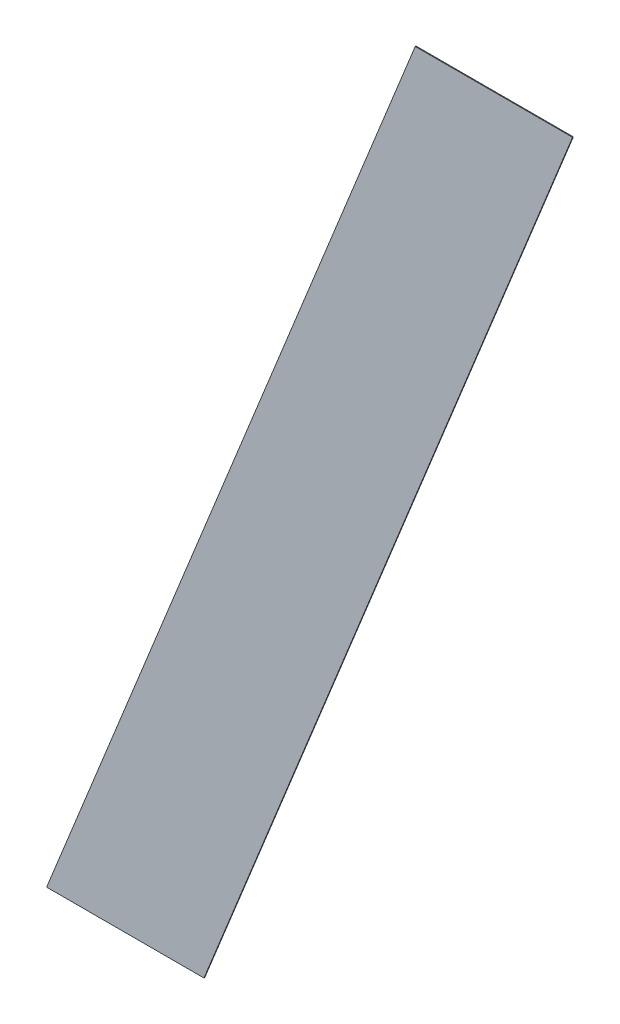
ISO-10303-21;
HEADER;
FILE_DESCRIPTION(('STEP AP214'),'2;1');
FILE_NAME('part.step','',(''),(''),'','','');
FILE_SCHEMA(('AUTOMOTIVE_DESIGN { 1 0 10303 214 1 1 1 1 }'));
ENDSEC;
DATA;
#1=APPLICATION_CONTEXT('core data for automotive mechanical design processes');
#2=APPLICATION_PROTOCOL_DEFINITION('international standard','automotive_design',2000,#1);
#3=PRODUCT_CONTEXT('',#1,'mechanical');
#4=PRODUCT('Part','Part','',(#3));
#5=PRODUCT_RELATED_PRODUCT_CATEGORY('part','',(#4));
#6=PRODUCT_DEFINITION_FORMATION('','',#4);
#7=PRODUCT_DEFINITION_CONTEXT('part definition',#1,'design');
#8=PRODUCT_DEFINITION('design','',#6,#7);
#9=PRODUCT_DEFINITION_SHAPE('','',#8);
#10=(LENGTH_UNIT() NAMED_UNIT(*) SI_UNIT(.MILLI.,.METRE.));
#11=(NAMED_UNIT(*) PLANE_ANGLE_UNIT() SI_UNIT($,.RADIAN.));
#12=(NAMED_UNIT(*) SI_UNIT($,.STERADIAN.) SOLID_ANGLE_UNIT());
#13=UNCERTAINTY_MEASURE_WITH_UNIT(LENGTH_MEASURE(1.E-05),#10,'distance_accuracy_value','');
#14=(GEOMETRIC_REPRESENTATION_CONTEXT(3) GLOBAL_UNCERTAINTY_ASSIGNED_CONTEXT((#13)) GLOBAL_UNIT_ASSIGNED_CONTEXT((#10,
#11,#12)) REPRESENTATION_CONTEXT('',''));
#15=CARTESIAN_POINT('',(0.,0.,0.));
#16=DIRECTION('',(0.,0.,1.));
#17=DIRECTION('',(1.,0.,0.));
#18=AXIS2_PLACEMENT_3D('',#15,#16,#17);
#19=CARTESIAN_POINT('',(0.3590009185743,-0.192580169588,0.0009));
#20=DIRECTION('',(0.,0.,-1.));
#21=DIRECTION('',(-1.,0.,0.));
#22=AXIS2_PLACEMENT_3D('',#19,#20,#21);
#23=PLANE('',#22);
#24=DIRECTION('',(-1.,0.,0.));
#25=VECTOR('',#24,1.);
#26=CARTESIAN_POINT('',(0.3458299068488,-0.192580169588,0.0009));
#27=LINE('',#26,#25);
#28=CARTESIAN_POINT('',(0.3458299068488,-0.192580169588,0.0009));
#29=VERTEX_POINT('',#28);
#30=CARTESIAN_POINT('',(0.3262099068488,-0.192580169588,0.0009));
#31=VERTEX_POINT('',#30);
#32=EDGE_CURVE('E11',#29,#31,#27,.T.);
#33=ORIENTED_EDGE('',*,*,#32,.T.);
#34=DIRECTION('',(0.37460659341586,0.927183854566808,0.));
#35=VECTOR('',#34,1.);
#36=CARTESIAN_POINT('',(0.3262099068488,-0.192580169588,0.0009));
#37=LINE('',#36,#35);
#38=CARTESIAN_POINT('',(0.3721719302998,-0.078820169588,0.0009));
#39=VERTEX_POINT('',#38);
#40=EDGE_CURVE('E24',#31,#39,#37,.T.);
#41=ORIENTED_EDGE('',*,*,#40,.T.);
#42=DIRECTION('',(1.,0.,0.));
#43=VECTOR('',#42,1.);
#44=CARTESIAN_POINT('',(0.3721719302998,-0.078820169588,0.0009));
#45=LINE('',#44,#43);
#46=CARTESIAN_POINT('',(0.3917919302998,-0.078820169588,0.0009));
#47=VERTEX_POINT('',#46);
#48=EDGE_CURVE('E70',#39,#47,#45,.T.);
#49=ORIENTED_EDGE('',*,*,#48,.T.);
#50=DIRECTION('',(-0.374606593415159,-0.927183854567092,0.));
#51=VECTOR('',#50,1.);
#52=CARTESIAN_POINT('',(0.3917919302998,-0.078820169588,0.0009));
#53=LINE('',#52,#51);
#54=EDGE_CURVE('E86',#47,#29,#53,.T.);
#55=ORIENTED_EDGE('',*,*,#54,.T.);
#56=EDGE_LOOP('',(#33,#41,#49,#55));
#57=FACE_BOUND('',#56,.T.);
#58=ADVANCED_FACE('F17',(#57),#23,.T.);
#59=CARTESIAN_POINT('',(0.3360199068488,-0.192580169588,0.0009));
#60=DIRECTION('',(0.,-1.,0.));
#61=DIRECTION('',(0.,0.,-1.));
#62=AXIS2_PLACEMENT_3D('',#59,#60,#61);
#63=PLANE('',#62);
#64=DIRECTION('',(1.,0.,0.));
#65=VECTOR('',#64,1.);
#66=CARTESIAN_POINT('',(0.3262099068488,-0.192580169588,0.001));
#67=LINE('',#66,#65);
#68=CARTESIAN_POINT('',(0.3262099068488,-0.192580169588,0.001));
#69=VERTEX_POINT('',#68);
#70=CARTESIAN_POINT('',(0.3458299068488,-0.192580169588,0.001));
#71=VERTEX_POINT('',#70);
#72=EDGE_CURVE('E84',#69,#71,#67,.T.);
#73=ORIENTED_EDGE('',*,*,#72,.F.);
#74=DIRECTION('',(0.,0.,-1.));
#75=VECTOR('',#74,1.);
#76=CARTESIAN_POINT('',(0.3262099068488,-0.192580169588,0.001));
#77=LINE('',#76,#75);
#78=EDGE_CURVE('E75',#69,#31,#77,.T.);
#79=ORIENTED_EDGE('',*,*,#78,.T.);
#80=ORIENTED_EDGE('',*,*,#32,.F.);
#81=DIRECTION('',(0.,0.,-1.));
#82=VECTOR('',#81,1.);
#83=CARTESIAN_POINT('',(0.3458299068488,-0.192580169588,0.001));
#84=LINE('',#83,#82);
#85=EDGE_CURVE('E80',#71,#29,#84,.T.);
#86=ORIENTED_EDGE('',*,*,#85,.F.);
#87=EDGE_LOOP('',(#73,#79,#80,#86));
#88=FACE_BOUND('',#87,.T.);
#89=ADVANCED_FACE('F89',(#88),#63,.T.);
#90=CARTESIAN_POINT('',(0.3688109185743,-0.135700169588,0.0009));
#91=DIRECTION('',(0.927183854566809,-0.37460659341586,0.));
#92=DIRECTION('',(0.,0.,-1.));
#93=AXIS2_PLACEMENT_3D('',#90,#91,#92);
#94=PLANE('',#93);
#95=DIRECTION('',(0.37460659341586,0.927183854566809,0.));
#96=VECTOR('',#95,1.);
#97=CARTESIAN_POINT('',(0.3458299068488,-0.192580169588,0.001));
#98=LINE('',#97,#96);
#99=CARTESIAN_POINT('',(0.3917919302998,-0.078820169588,0.001));
#100=VERTEX_POINT('',#99);
#101=EDGE_CURVE('E60',#71,#100,#98,.T.);
#102=ORIENTED_EDGE('',*,*,#101,.F.);
#103=ORIENTED_EDGE('',*,*,#85,.T.);
#104=ORIENTED_EDGE('',*,*,#54,.F.);
#105=DIRECTION('',(0.,0.,-1.));
#106=VECTOR('',#105,1.);
#107=CARTESIAN_POINT('',(0.3917919302998,-0.078820169588,0.001));
#108=LINE('',#107,#106);
#109=EDGE_CURVE('E64',#100,#47,#108,.T.);
#110=ORIENTED_EDGE('',*,*,#109,.F.);
#111=EDGE_LOOP('',(#102,#103,#104,#110));
#112=FACE_BOUND('',#111,.T.);
#113=ADVANCED_FACE('F91',(#112),#94,.T.);
#114=CARTESIAN_POINT('',(0.3819819302998,-0.078820169588,0.0009));
#115=DIRECTION('',(0.,1.,0.));
#116=DIRECTION('',(0.,0.,1.));
#117=AXIS2_PLACEMENT_3D('',#114,#115,#116);
#118=PLANE('',#117);
#119=DIRECTION('',(-1.,0.,0.));
#120=VECTOR('',#119,1.);
#121=CARTESIAN_POINT('',(0.3917919302998,-0.078820169588,0.001));
#122=LINE('',#121,#120);
#123=CARTESIAN_POINT('',(0.3721719302998,-0.078820169588,0.001));
#124=VERTEX_POINT('',#123);
#125=EDGE_CURVE('E54',#100,#124,#122,.T.);
#126=ORIENTED_EDGE('',*,*,#125,.F.);
#127=ORIENTED_EDGE('',*,*,#109,.T.);
#128=ORIENTED_EDGE('',*,*,#48,.F.);
#129=DIRECTION('',(0.,0.,-1.));
#130=VECTOR('',#129,1.);
#131=CARTESIAN_POINT('',(0.3721719302998,-0.078820169588,0.001));
#132=LINE('',#131,#130);
#133=EDGE_CURVE('E65',#124,#39,#132,.T.);
#134=ORIENTED_EDGE('',*,*,#133,.F.);
#135=EDGE_LOOP('',(#126,#127,#128,#134));
#136=FACE_BOUND('',#135,.T.);
#137=ADVANCED_FACE('F69',(#136),#118,.T.);
#138=CARTESIAN_POINT('',(0.3491909185743,-0.135700169588,0.0009));
#139=DIRECTION('',(-0.927183854566808,0.37460659341586,0.));
#140=DIRECTION('',(0.,0.,1.));
#141=AXIS2_PLACEMENT_3D('',#138,#139,#140);
#142=PLANE('',#141);
#143=DIRECTION('',(-0.37460659341586,-0.927183854566808,0.));
#144=VECTOR('',#143,1.);
#145=CARTESIAN_POINT('',(0.3721719302998,-0.078820169588,0.001));
#146=LINE('',#145,#144);
#147=EDGE_CURVE('E58',#124,#69,#146,.T.);
#148=ORIENTED_EDGE('',*,*,#147,.F.);
#149=ORIENTED_EDGE('',*,*,#133,.T.);
#150=ORIENTED_EDGE('',*,*,#40,.F.);
#151=ORIENTED_EDGE('',*,*,#78,.F.);
#152=EDGE_LOOP('',(#148,#149,#150,#151));
#153=FACE_BOUND('',#152,.T.);
#154=ADVANCED_FACE('F74',(#153),#142,.T.);
#155=CARTESIAN_POINT('',(0.3590009185743,-0.192580169588,0.001));
#156=DIRECTION('',(0.,0.,-1.));
#157=DIRECTION('',(-1.,0.,0.));
#158=AXIS2_PLACEMENT_3D('',#155,#156,#157);
#159=PLANE('',#158);
#160=ORIENTED_EDGE('',*,*,#125,.T.);
#161=ORIENTED_EDGE('',*,*,#147,.T.);
#162=ORIENTED_EDGE('',*,*,#72,.T.);
#163=ORIENTED_EDGE('',*,*,#101,.T.);
#164=EDGE_LOOP('',(#160,#161,#162,#163));
#165=FACE_BOUND('',#164,.T.);
#166=ADVANCED_FACE('F56',(#165),#159,.F.);
#167=CLOSED_SHELL('',(#58,#89,#113,#137,#154,#166));
#168=MANIFOLD_SOLID_BREP('B1',#167);
#169=ADVANCED_BREP_SHAPE_REPRESENTATION('',(#18,#168),#14);
#170=SHAPE_DEFINITION_REPRESENTATION(#9,#169);
ENDSEC;
END-ISO-10303-21;
